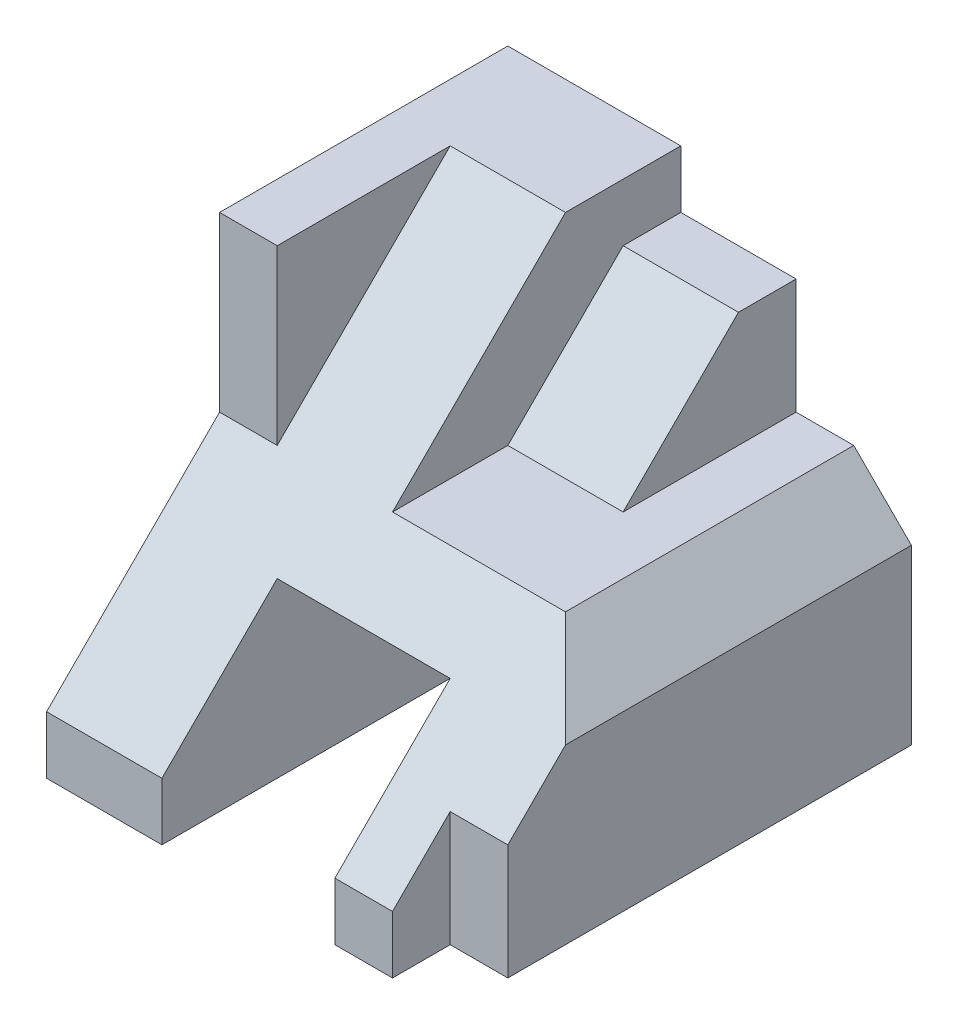
ISO-10303-21;
HEADER;
FILE_DESCRIPTION(('STEP AP214'),'2;1');
FILE_NAME('part.step','',(''),(''),'','','');
FILE_SCHEMA(('AUTOMOTIVE_DESIGN { 1 0 10303 214 1 1 1 1 }'));
ENDSEC;
DATA;
#1=APPLICATION_CONTEXT('core data for automotive mechanical design processes');
#2=APPLICATION_PROTOCOL_DEFINITION('international standard','automotive_design',2000,#1);
#3=PRODUCT_CONTEXT('',#1,'mechanical');
#4=PRODUCT('Part','Part','',(#3));
#5=PRODUCT_RELATED_PRODUCT_CATEGORY('part','',(#4));
#6=PRODUCT_DEFINITION_FORMATION('','',#4);
#7=PRODUCT_DEFINITION_CONTEXT('part definition',#1,'design');
#8=PRODUCT_DEFINITION('design','',#6,#7);
#9=PRODUCT_DEFINITION_SHAPE('','',#8);
#10=(LENGTH_UNIT() NAMED_UNIT(*) SI_UNIT(.MILLI.,.METRE.));
#11=(NAMED_UNIT(*) PLANE_ANGLE_UNIT() SI_UNIT($,.RADIAN.));
#12=(NAMED_UNIT(*) SI_UNIT($,.STERADIAN.) SOLID_ANGLE_UNIT());
#13=UNCERTAINTY_MEASURE_WITH_UNIT(LENGTH_MEASURE(1.E-05),#10,'distance_accuracy_value','');
#14=(GEOMETRIC_REPRESENTATION_CONTEXT(3) GLOBAL_UNCERTAINTY_ASSIGNED_CONTEXT((#13)) GLOBAL_UNIT_ASSIGNED_CONTEXT((#10,
#11,#12)) REPRESENTATION_CONTEXT('',''));
#15=CARTESIAN_POINT('',(0.,0.,0.));
#16=DIRECTION('',(0.,0.,1.));
#17=DIRECTION('',(1.,0.,0.));
#18=AXIS2_PLACEMENT_3D('',#15,#16,#17);
#19=CARTESIAN_POINT('',(3.5,-3.5,8.));
#20=DIRECTION('',(-1.,0.,0.));
#21=DIRECTION('',(0.,0.,1.));
#22=AXIS2_PLACEMENT_3D('',#19,#20,#21);
#23=PLANE('',#22);
#24=DIRECTION('',(0.,1.,0.));
#25=VECTOR('',#24,1.);
#26=CARTESIAN_POINT('',(3.5,-3.5,0.));
#27=LINE('',#26,#25);
#28=CARTESIAN_POINT('',(3.5,-3.5,0.));
#29=VERTEX_POINT('',#28);
#30=CARTESIAN_POINT('',(3.5,-0.500000000000017,0.));
#31=VERTEX_POINT('',#30);
#32=EDGE_CURVE('E183',#29,#31,#27,.T.);
#33=ORIENTED_EDGE('',*,*,#32,.T.);
#34=DIRECTION('',(0.,0.,-1.));
#35=VECTOR('',#34,1.);
#36=CARTESIAN_POINT('',(3.5,-0.500000000000017,6.));
#37=LINE('',#36,#35);
#38=CARTESIAN_POINT('',(3.5,-0.500000000000017,6.));
#39=VERTEX_POINT('',#38);
#40=EDGE_CURVE('E170',#39,#31,#37,.T.);
#41=ORIENTED_EDGE('',*,*,#40,.F.);
#42=DIRECTION('',(0.,0.707106781186547,-0.707106781186548));
#43=VECTOR('',#42,1.);
#44=CARTESIAN_POINT('',(3.5,-2.5,8.));
#45=LINE('',#44,#43);
#46=CARTESIAN_POINT('',(3.5,-1.5,7.));
#47=VERTEX_POINT('',#46);
#48=EDGE_CURVE('E181',#47,#39,#45,.T.);
#49=ORIENTED_EDGE('',*,*,#48,.F.);
#50=DIRECTION('',(0.,1.,0.));
#51=VECTOR('',#50,1.);
#52=CARTESIAN_POINT('',(3.5,-3.5,7.));
#53=LINE('',#52,#51);
#54=CARTESIAN_POINT('',(3.5,-3.5,7.));
#55=VERTEX_POINT('',#54);
#56=EDGE_CURVE('E284',#55,#47,#53,.T.);
#57=ORIENTED_EDGE('',*,*,#56,.F.);
#58=DIRECTION('',(0.,0.,-1.));
#59=VECTOR('',#58,1.);
#60=CARTESIAN_POINT('',(3.5,-3.5,8.));
#61=LINE('',#60,#59);
#62=EDGE_CURVE('E256',#55,#29,#61,.T.);
#63=ORIENTED_EDGE('',*,*,#62,.T.);
#64=EDGE_LOOP('',(#33,#41,#49,#57,#63));
#65=FACE_BOUND('',#64,.T.);
#66=ADVANCED_FACE('F33',(#65),#23,.F.);
#67=CARTESIAN_POINT('',(3.5,3.5,8.));
#68=DIRECTION('',(0.,-1.,0.));
#69=DIRECTION('',(1.,0.,0.));
#70=AXIS2_PLACEMENT_3D('',#67,#68,#69);
#71=PLANE('',#70);
#72=DIRECTION('',(0.,0.,1.));
#73=VECTOR('',#72,1.);
#74=CARTESIAN_POINT('',(-0.5,3.5,0.));
#75=LINE('',#74,#73);
#76=CARTESIAN_POINT('',(-0.5,3.5,0.));
#77=VERTEX_POINT('',#76);
#78=CARTESIAN_POINT('',(-0.5,3.5,2.));
#79=VERTEX_POINT('',#78);
#80=EDGE_CURVE('E358',#77,#79,#75,.T.);
#81=ORIENTED_EDGE('',*,*,#80,.F.);
#82=DIRECTION('',(-1.,0.,0.));
#83=VECTOR('',#82,1.);
#84=CARTESIAN_POINT('',(3.5,3.5,0.));
#85=LINE('',#84,#83);
#86=CARTESIAN_POINT('',(-3.5,3.5,0.));
#87=VERTEX_POINT('',#86);
#88=EDGE_CURVE('E241',#77,#87,#85,.T.);
#89=ORIENTED_EDGE('',*,*,#88,.T.);
#90=DIRECTION('',(0.,0.,-1.));
#91=VECTOR('',#90,1.);
#92=CARTESIAN_POINT('',(-3.5,3.5,8.));
#93=LINE('',#92,#91);
#94=CARTESIAN_POINT('',(-3.5,3.5,5.));
#95=VERTEX_POINT('',#94);
#96=EDGE_CURVE('E245',#95,#87,#93,.T.);
#97=ORIENTED_EDGE('',*,*,#96,.F.);
#98=DIRECTION('',(1.,0.,0.));
#99=VECTOR('',#98,1.);
#100=CARTESIAN_POINT('',(-8.5,3.5,5.));
#101=LINE('',#100,#99);
#102=CARTESIAN_POINT('',(-2.5,3.5,5.));
#103=VERTEX_POINT('',#102);
#104=EDGE_CURVE('E305',#95,#103,#101,.T.);
#105=ORIENTED_EDGE('',*,*,#104,.T.);
#106=DIRECTION('',(0.,0.,1.));
#107=VECTOR('',#106,1.);
#108=CARTESIAN_POINT('',(-2.5,3.5,2.));
#109=LINE('',#108,#107);
#110=CARTESIAN_POINT('',(-2.5,3.5,2.));
#111=VERTEX_POINT('',#110);
#112=EDGE_CURVE('E193',#111,#103,#109,.T.);
#113=ORIENTED_EDGE('',*,*,#112,.F.);
#114=DIRECTION('',(1.,0.,0.));
#115=VECTOR('',#114,1.);
#116=CARTESIAN_POINT('',(-2.5,3.5,2.));
#117=LINE('',#116,#115);
#118=EDGE_CURVE('E200',#111,#79,#117,.T.);
#119=ORIENTED_EDGE('',*,*,#118,.T.);
#120=EDGE_LOOP('',(#81,#89,#97,#105,#113,#119));
#121=FACE_BOUND('',#120,.T.);
#122=ADVANCED_FACE('F373',(#121),#71,.F.);
#123=CARTESIAN_POINT('',(0.,0.,8.));
#124=DIRECTION('',(0.,0.,1.));
#125=DIRECTION('',(1.,0.,0.));
#126=AXIS2_PLACEMENT_3D('',#123,#124,#125);
#127=PLANE('',#126);
#128=DIRECTION('',(1.,0.,0.));
#129=VECTOR('',#128,1.);
#130=CARTESIAN_POINT('',(3.5,-3.5,8.));
#131=LINE('',#130,#129);
#132=CARTESIAN_POINT('',(1.5,-3.5,8.));
#133=VERTEX_POINT('',#132);
#134=CARTESIAN_POINT('',(2.5,-3.5,8.));
#135=VERTEX_POINT('',#134);
#136=EDGE_CURVE('E240',#133,#135,#131,.T.);
#137=ORIENTED_EDGE('',*,*,#136,.T.);
#138=DIRECTION('',(0.,-1.,0.));
#139=VECTOR('',#138,1.);
#140=CARTESIAN_POINT('',(2.5,-1.5,8.));
#141=LINE('',#140,#139);
#142=CARTESIAN_POINT('',(2.5,-2.5,8.));
#143=VERTEX_POINT('',#142);
#144=EDGE_CURVE('E291',#143,#135,#141,.T.);
#145=ORIENTED_EDGE('',*,*,#144,.F.);
#146=DIRECTION('',(1.,0.,0.));
#147=VECTOR('',#146,1.);
#148=CARTESIAN_POINT('',(-2.5,-2.5,8.));
#149=LINE('',#148,#147);
#150=CARTESIAN_POINT('',(1.5,-2.5,8.));
#151=VERTEX_POINT('',#150);
#152=EDGE_CURVE('E206',#151,#143,#149,.T.);
#153=ORIENTED_EDGE('',*,*,#152,.F.);
#154=DIRECTION('',(0.,1.,0.));
#155=VECTOR('',#154,1.);
#156=CARTESIAN_POINT('',(1.5,-0.5,8.));
#157=LINE('',#156,#155);
#158=EDGE_CURVE('E212',#133,#151,#157,.T.);
#159=ORIENTED_EDGE('',*,*,#158,.F.);
#160=EDGE_LOOP('',(#137,#145,#153,#159));
#161=FACE_BOUND('',#160,.T.);
#162=ADVANCED_FACE('F332',(#161),#127,.T.);
#163=CARTESIAN_POINT('',(3.5,-3.5,8.));
#164=DIRECTION('',(0.,1.,0.));
#165=DIRECTION('',(-1.,0.,0.));
#166=AXIS2_PLACEMENT_3D('',#163,#164,#165);
#167=PLANE('',#166);
#168=DIRECTION('',(1.,0.,0.));
#169=VECTOR('',#168,1.);
#170=CARTESIAN_POINT('',(3.5,-3.5,0.));
#171=LINE('',#170,#169);
#172=CARTESIAN_POINT('',(-3.5,-3.5,0.));
#173=VERTEX_POINT('',#172);
#174=CARTESIAN_POINT('',(-1.5,-3.5,0.));
#175=VERTEX_POINT('',#174);
#176=EDGE_CURVE('E249',#173,#175,#171,.T.);
#177=ORIENTED_EDGE('',*,*,#176,.T.);
#178=DIRECTION('',(0.,0.,1.));
#179=VECTOR('',#178,1.);
#180=CARTESIAN_POINT('',(-1.5,-3.5,0.));
#181=LINE('',#180,#179);
#182=CARTESIAN_POINT('',(-1.5,-3.5,8.));
#183=VERTEX_POINT('',#182);
#184=EDGE_CURVE('E227',#175,#183,#181,.T.);
#185=ORIENTED_EDGE('',*,*,#184,.T.);
#186=CARTESIAN_POINT('',(-3.5,-3.5,8.));
#187=VERTEX_POINT('',#186);
#188=EDGE_CURVE('E242',#187,#183,#131,.T.);
#189=ORIENTED_EDGE('',*,*,#188,.F.);
#190=DIRECTION('',(0.,0.,-1.));
#191=VECTOR('',#190,1.);
#192=CARTESIAN_POINT('',(-3.5,-3.5,8.));
#193=LINE('',#192,#191);
#194=EDGE_CURVE('E258',#187,#173,#193,.T.);
#195=ORIENTED_EDGE('',*,*,#194,.T.);
#196=EDGE_LOOP('',(#177,#185,#189,#195));
#197=FACE_BOUND('',#196,.T.);
#198=ADVANCED_FACE('F376',(#197),#167,.F.);
#199=CARTESIAN_POINT('',(-3.5,-3.5,8.));
#200=DIRECTION('',(1.,0.,0.));
#201=DIRECTION('',(0.,0.,-1.));
#202=AXIS2_PLACEMENT_3D('',#199,#200,#201);
#203=PLANE('',#202);
#204=DIRECTION('',(0.,0.707106781186548,-0.707106781186547));
#205=VECTOR('',#204,1.);
#206=CARTESIAN_POINT('',(-3.5,-3.,8.5));
#207=LINE('',#206,#205);
#208=CARTESIAN_POINT('',(-3.5,-2.5,8.));
#209=VERTEX_POINT('',#208);
#210=CARTESIAN_POINT('',(-3.5,0.500000000000002,5.));
#211=VERTEX_POINT('',#210);
#212=EDGE_CURVE('E196',#209,#211,#207,.T.);
#213=ORIENTED_EDGE('',*,*,#212,.T.);
#214=DIRECTION('',(0.,1.,0.));
#215=VECTOR('',#214,1.);
#216=CARTESIAN_POINT('',(-3.5,-3.5,5.));
#217=LINE('',#216,#215);
#218=EDGE_CURVE('E191',#211,#95,#217,.T.);
#219=ORIENTED_EDGE('',*,*,#218,.T.);
#220=ORIENTED_EDGE('',*,*,#96,.T.);
#221=DIRECTION('',(0.,-1.,0.));
#222=VECTOR('',#221,1.);
#223=CARTESIAN_POINT('',(-3.5,-3.5,0.));
#224=LINE('',#223,#222);
#225=EDGE_CURVE('E230',#87,#173,#224,.T.);
#226=ORIENTED_EDGE('',*,*,#225,.T.);
#227=ORIENTED_EDGE('',*,*,#194,.F.);
#228=DIRECTION('',(0.,-1.,0.));
#229=VECTOR('',#228,1.);
#230=CARTESIAN_POINT('',(-3.5,-3.5,8.));
#231=LINE('',#230,#229);
#232=EDGE_CURVE('E238',#209,#187,#231,.T.);
#233=ORIENTED_EDGE('',*,*,#232,.F.);
#234=EDGE_LOOP('',(#213,#219,#220,#226,#227,#233));
#235=FACE_BOUND('',#234,.T.);
#236=ADVANCED_FACE('F35',(#235),#203,.F.);
#237=ORIENTED_EDGE('',*,*,#62,.F.);
#238=DIRECTION('',(1.,0.,0.));
#239=VECTOR('',#238,1.);
#240=CARTESIAN_POINT('',(2.5,-3.5,7.));
#241=LINE('',#240,#239);
#242=CARTESIAN_POINT('',(2.5,-3.5,7.));
#243=VERTEX_POINT('',#242);
#244=EDGE_CURVE('E298',#243,#55,#241,.T.);
#245=ORIENTED_EDGE('',*,*,#244,.F.);
#246=DIRECTION('',(0.,0.,-1.));
#247=VECTOR('',#246,1.);
#248=CARTESIAN_POINT('',(2.5,-3.5,8.));
#249=LINE('',#248,#247);
#250=EDGE_CURVE('E293',#135,#243,#249,.T.);
#251=ORIENTED_EDGE('',*,*,#250,.F.);
#252=ORIENTED_EDGE('',*,*,#136,.F.);
#253=DIRECTION('',(0.,0.,1.));
#254=VECTOR('',#253,1.);
#255=CARTESIAN_POINT('',(1.5,-3.5,0.));
#256=LINE('',#255,#254);
#257=CARTESIAN_POINT('',(1.5,-3.5,0.));
#258=VERTEX_POINT('',#257);
#259=EDGE_CURVE('E223',#258,#133,#256,.T.);
#260=ORIENTED_EDGE('',*,*,#259,.F.);
#261=EDGE_CURVE('E248',#258,#29,#171,.T.);
#262=ORIENTED_EDGE('',*,*,#261,.T.);
#263=EDGE_LOOP('',(#237,#245,#251,#252,#260,#262));
#264=FACE_BOUND('',#263,.T.);
#265=ADVANCED_FACE('F342',(#264),#167,.F.);
#266=CARTESIAN_POINT('',(-1.5,-2.5,8.));
#267=VERTEX_POINT('',#266);
#268=EDGE_CURVE('E204',#209,#267,#149,.T.);
#269=ORIENTED_EDGE('',*,*,#268,.F.);
#270=ORIENTED_EDGE('',*,*,#232,.T.);
#271=ORIENTED_EDGE('',*,*,#188,.T.);
#272=DIRECTION('',(0.,-1.,0.));
#273=VECTOR('',#272,1.);
#274=CARTESIAN_POINT('',(-1.5,-3.5,8.));
#275=LINE('',#274,#273);
#276=EDGE_CURVE('E217',#267,#183,#275,.T.);
#277=ORIENTED_EDGE('',*,*,#276,.F.);
#278=EDGE_LOOP('',(#269,#270,#271,#277));
#279=FACE_BOUND('',#278,.T.);
#280=ADVANCED_FACE('F379',(#279),#127,.T.);
#281=CARTESIAN_POINT('',(0.,0.,0.));
#282=DIRECTION('',(0.,0.,1.));
#283=DIRECTION('',(1.,0.,0.));
#284=AXIS2_PLACEMENT_3D('',#281,#282,#283);
#285=PLANE('',#284);
#286=DIRECTION('',(-1.,0.,0.));
#287=VECTOR('',#286,1.);
#288=CARTESIAN_POINT('',(3.5,0.500000000000001,0.));
#289=LINE('',#288,#287);
#290=CARTESIAN_POINT('',(2.5,0.500000000000001,0.));
#291=VERTEX_POINT('',#290);
#292=CARTESIAN_POINT('',(1.5,0.500000000000001,0.));
#293=VERTEX_POINT('',#292);
#294=EDGE_CURVE('E348',#291,#293,#289,.T.);
#295=ORIENTED_EDGE('',*,*,#294,.F.);
#296=DIRECTION('',(-0.707106781186541,0.707106781186554,0.));
#297=VECTOR('',#296,1.);
#298=CARTESIAN_POINT('',(2.5,0.500000000000001,0.));
#299=LINE('',#298,#297);
#300=EDGE_CURVE('E48',#31,#291,#299,.T.);
#301=ORIENTED_EDGE('',*,*,#300,.F.);
#302=ORIENTED_EDGE('',*,*,#32,.F.);
#303=ORIENTED_EDGE('',*,*,#261,.F.);
#304=DIRECTION('',(0.,1.,0.));
#305=VECTOR('',#304,1.);
#306=CARTESIAN_POINT('',(1.5,-0.5,0.));
#307=LINE('',#306,#305);
#308=CARTESIAN_POINT('',(1.5,-0.5,0.));
#309=VERTEX_POINT('',#308);
#310=EDGE_CURVE('E213',#258,#309,#307,.T.);
#311=ORIENTED_EDGE('',*,*,#310,.T.);
#312=DIRECTION('',(-1.,0.,0.));
#313=VECTOR('',#312,1.);
#314=CARTESIAN_POINT('',(-1.5,-0.5,0.));
#315=LINE('',#314,#313);
#316=CARTESIAN_POINT('',(-1.5,-0.5,0.));
#317=VERTEX_POINT('',#316);
#318=EDGE_CURVE('E216',#309,#317,#315,.T.);
#319=ORIENTED_EDGE('',*,*,#318,.T.);
#320=DIRECTION('',(0.,-1.,0.));
#321=VECTOR('',#320,1.);
#322=CARTESIAN_POINT('',(-1.5,-3.5,0.));
#323=LINE('',#322,#321);
#324=EDGE_CURVE('E220',#317,#175,#323,.T.);
#325=ORIENTED_EDGE('',*,*,#324,.T.);
#326=ORIENTED_EDGE('',*,*,#176,.F.);
#327=ORIENTED_EDGE('',*,*,#225,.F.);
#328=ORIENTED_EDGE('',*,*,#88,.F.);
#329=DIRECTION('',(0.,1.,0.));
#330=VECTOR('',#329,1.);
#331=CARTESIAN_POINT('',(-0.5,2.5,0.));
#332=LINE('',#331,#330);
#333=CARTESIAN_POINT('',(-0.5,2.5,0.));
#334=VERTEX_POINT('',#333);
#335=EDGE_CURVE('E356',#334,#77,#332,.T.);
#336=ORIENTED_EDGE('',*,*,#335,.F.);
#337=DIRECTION('',(1.,0.,0.));
#338=VECTOR('',#337,1.);
#339=CARTESIAN_POINT('',(-0.5,2.5,0.));
#340=LINE('',#339,#338);
#341=CARTESIAN_POINT('',(1.5,2.5,0.));
#342=VERTEX_POINT('',#341);
#343=EDGE_CURVE('E282',#334,#342,#340,.T.);
#344=ORIENTED_EDGE('',*,*,#343,.T.);
#345=DIRECTION('',(0.,1.,0.));
#346=VECTOR('',#345,1.);
#347=CARTESIAN_POINT('',(1.5,0.500000000000001,0.));
#348=LINE('',#347,#346);
#349=EDGE_CURVE('E353',#293,#342,#348,.T.);
#350=ORIENTED_EDGE('',*,*,#349,.F.);
#351=EDGE_LOOP('',(#295,#301,#302,#303,#311,#319,#325,#326,#327,#328,#336,#344,#350));
#352=FACE_BOUND('',#351,.T.);
#353=ADVANCED_FACE('F346',(#352),#285,.F.);
#354=CARTESIAN_POINT('',(-1.5,-3.5,0.));
#355=DIRECTION('',(-1.,0.,0.));
#356=DIRECTION('',(0.,0.,1.));
#357=AXIS2_PLACEMENT_3D('',#354,#355,#356);
#358=PLANE('',#357);
#359=DIRECTION('',(0.,0.,1.));
#360=VECTOR('',#359,1.);
#361=CARTESIAN_POINT('',(-1.5,-0.5,0.));
#362=LINE('',#361,#360);
#363=CARTESIAN_POINT('',(-1.5,-0.5,6.));
#364=VERTEX_POINT('',#363);
#365=EDGE_CURVE('E231',#317,#364,#362,.T.);
#366=ORIENTED_EDGE('',*,*,#365,.T.);
#367=DIRECTION('',(0.,-0.707106781186547,0.707106781186548));
#368=VECTOR('',#367,1.);
#369=CARTESIAN_POINT('',(-1.5,1.,4.5));
#370=LINE('',#369,#368);
#371=EDGE_CURVE('E209',#364,#267,#370,.T.);
#372=ORIENTED_EDGE('',*,*,#371,.T.);
#373=ORIENTED_EDGE('',*,*,#276,.T.);
#374=ORIENTED_EDGE('',*,*,#184,.F.);
#375=ORIENTED_EDGE('',*,*,#324,.F.);
#376=EDGE_LOOP('',(#366,#372,#373,#374,#375));
#377=FACE_BOUND('',#376,.T.);
#378=ADVANCED_FACE('F381',(#377),#358,.F.);
#379=CARTESIAN_POINT('',(-1.5,-0.5,0.));
#380=DIRECTION('',(0.,1.,0.));
#381=DIRECTION('',(0.,0.,1.));
#382=AXIS2_PLACEMENT_3D('',#379,#380,#381);
#383=PLANE('',#382);
#384=DIRECTION('',(0.,0.,1.));
#385=VECTOR('',#384,1.);
#386=CARTESIAN_POINT('',(1.5,-0.5,0.));
#387=LINE('',#386,#385);
#388=CARTESIAN_POINT('',(1.5,-0.5,6.));
#389=VERTEX_POINT('',#388);
#390=EDGE_CURVE('E234',#309,#389,#387,.T.);
#391=ORIENTED_EDGE('',*,*,#390,.T.);
#392=DIRECTION('',(-1.,0.,0.));
#393=VECTOR('',#392,1.);
#394=CARTESIAN_POINT('',(-1.5,-0.5,6.));
#395=LINE('',#394,#393);
#396=EDGE_CURVE('E203',#389,#364,#395,.T.);
#397=ORIENTED_EDGE('',*,*,#396,.T.);
#398=ORIENTED_EDGE('',*,*,#365,.F.);
#399=ORIENTED_EDGE('',*,*,#318,.F.);
#400=EDGE_LOOP('',(#391,#397,#398,#399));
#401=FACE_BOUND('',#400,.T.);
#402=ADVANCED_FACE('F384',(#401),#383,.F.);
#403=CARTESIAN_POINT('',(1.5,-0.5,0.));
#404=DIRECTION('',(1.,0.,0.));
#405=DIRECTION('',(0.,0.,-1.));
#406=AXIS2_PLACEMENT_3D('',#403,#404,#405);
#407=PLANE('',#406);
#408=ORIENTED_EDGE('',*,*,#158,.T.);
#409=DIRECTION('',(0.,0.707106781186547,-0.707106781186548));
#410=VECTOR('',#409,1.);
#411=CARTESIAN_POINT('',(1.5,2.5,3.));
#412=LINE('',#411,#410);
#413=EDGE_CURVE('E261',#151,#389,#412,.T.);
#414=ORIENTED_EDGE('',*,*,#413,.T.);
#415=ORIENTED_EDGE('',*,*,#390,.F.);
#416=ORIENTED_EDGE('',*,*,#310,.F.);
#417=ORIENTED_EDGE('',*,*,#259,.T.);
#418=EDGE_LOOP('',(#408,#414,#415,#416,#417));
#419=FACE_BOUND('',#418,.T.);
#420=ADVANCED_FACE('F335',(#419),#407,.F.);
#421=CARTESIAN_POINT('',(-2.5,-2.5,8.));
#422=DIRECTION('',(0.,-0.707106781186548,-0.707106781186547));
#423=DIRECTION('',(0.,0.707106781186547,-0.707106781186548));
#424=AXIS2_PLACEMENT_3D('',#421,#422,#423);
#425=PLANE('',#424);
#426=ORIENTED_EDGE('',*,*,#48,.T.);
#427=DIRECTION('',(-0.577350269189619,0.577350269189629,-0.577350269189629));
#428=VECTOR('',#427,1.);
#429=CARTESIAN_POINT('',(2.83333333333336,0.166666666666634,5.33333333333337));
#430=LINE('',#429,#428);
#431=CARTESIAN_POINT('',(2.5,0.500000000000001,5.));
#432=VERTEX_POINT('',#431);
#433=EDGE_CURVE('E167',#39,#432,#430,.T.);
#434=ORIENTED_EDGE('',*,*,#433,.T.);
#435=DIRECTION('',(1.,0.,0.));
#436=VECTOR('',#435,1.);
#437=CARTESIAN_POINT('',(-0.5,0.500000000000002,5.));
#438=LINE('',#437,#436);
#439=CARTESIAN_POINT('',(-0.5,0.500000000000002,5.));
#440=VERTEX_POINT('',#439);
#441=EDGE_CURVE('E286',#440,#432,#438,.T.);
#442=ORIENTED_EDGE('',*,*,#441,.F.);
#443=DIRECTION('',(0.,-0.707106781186547,0.707106781186548));
#444=VECTOR('',#443,1.);
#445=CARTESIAN_POINT('',(-0.5,3.5,2.));
#446=LINE('',#445,#444);
#447=EDGE_CURVE('E360',#79,#440,#446,.T.);
#448=ORIENTED_EDGE('',*,*,#447,.F.);
#449=ORIENTED_EDGE('',*,*,#118,.F.);
#450=DIRECTION('',(0.,0.707106781186547,-0.707106781186548));
#451=VECTOR('',#450,1.);
#452=CARTESIAN_POINT('',(-2.5,-2.5,8.));
#453=LINE('',#452,#451);
#454=CARTESIAN_POINT('',(-2.5,0.500000000000002,5.));
#455=VERTEX_POINT('',#454);
#456=EDGE_CURVE('E190',#455,#111,#453,.T.);
#457=ORIENTED_EDGE('',*,*,#456,.F.);
#458=DIRECTION('',(1.,0.,0.));
#459=VECTOR('',#458,1.);
#460=CARTESIAN_POINT('',(-8.5,0.500000000000002,5.));
#461=LINE('',#460,#459);
#462=EDGE_CURVE('E304',#211,#455,#461,.T.);
#463=ORIENTED_EDGE('',*,*,#462,.F.);
#464=ORIENTED_EDGE('',*,*,#212,.F.);
#465=ORIENTED_EDGE('',*,*,#268,.T.);
#466=ORIENTED_EDGE('',*,*,#371,.F.);
#467=ORIENTED_EDGE('',*,*,#396,.F.);
#468=ORIENTED_EDGE('',*,*,#413,.F.);
#469=ORIENTED_EDGE('',*,*,#152,.T.);
#470=DIRECTION('',(0.,-0.707106781186547,0.707106781186548));
#471=VECTOR('',#470,1.);
#472=CARTESIAN_POINT('',(2.5,-2.5,8.));
#473=LINE('',#472,#471);
#474=CARTESIAN_POINT('',(2.5,-1.5,7.));
#475=VERTEX_POINT('',#474);
#476=EDGE_CURVE('E264',#475,#143,#473,.T.);
#477=ORIENTED_EDGE('',*,*,#476,.F.);
#478=DIRECTION('',(1.,0.,0.));
#479=VECTOR('',#478,1.);
#480=CARTESIAN_POINT('',(2.5,-1.5,7.));
#481=LINE('',#480,#479);
#482=EDGE_CURVE('E189',#475,#47,#481,.T.);
#483=ORIENTED_EDGE('',*,*,#482,.T.);
#484=EDGE_LOOP('',(#426,#434,#442,#448,#449,#457,#463,#464,#465,#466,#467,#468,#469,#477,#483));
#485=FACE_BOUND('',#484,.T.);
#486=ADVANCED_FACE('F186',(#485),#425,.F.);
#487=CARTESIAN_POINT('',(-2.5,0.,0.));
#488=DIRECTION('',(-1.,0.,0.));
#489=DIRECTION('',(0.,0.,1.));
#490=AXIS2_PLACEMENT_3D('',#487,#488,#489);
#491=PLANE('',#490);
#492=ORIENTED_EDGE('',*,*,#112,.T.);
#493=DIRECTION('',(0.,1.,0.));
#494=VECTOR('',#493,1.);
#495=CARTESIAN_POINT('',(-2.5,3.5,5.));
#496=LINE('',#495,#494);
#497=EDGE_CURVE('E301',#455,#103,#496,.T.);
#498=ORIENTED_EDGE('',*,*,#497,.F.);
#499=ORIENTED_EDGE('',*,*,#456,.T.);
#500=EDGE_LOOP('',(#492,#498,#499));
#501=FACE_BOUND('',#500,.T.);
#502=ADVANCED_FACE('F323',(#501),#491,.F.);
#503=CARTESIAN_POINT('',(-8.5,3.5,5.));
#504=DIRECTION('',(0.,0.,-1.));
#505=DIRECTION('',(0.,1.,0.));
#506=AXIS2_PLACEMENT_3D('',#503,#504,#505);
#507=PLANE('',#506);
#508=ORIENTED_EDGE('',*,*,#462,.T.);
#509=ORIENTED_EDGE('',*,*,#497,.T.);
#510=ORIENTED_EDGE('',*,*,#104,.F.);
#511=ORIENTED_EDGE('',*,*,#218,.F.);
#512=EDGE_LOOP('',(#508,#509,#510,#511));
#513=FACE_BOUND('',#512,.T.);
#514=ADVANCED_FACE('F320',(#513),#507,.F.);
#515=CARTESIAN_POINT('',(2.5,0.,0.));
#516=DIRECTION('',(1.,0.,0.));
#517=DIRECTION('',(0.,0.,-1.));
#518=AXIS2_PLACEMENT_3D('',#515,#516,#517);
#519=PLANE('',#518);
#520=ORIENTED_EDGE('',*,*,#476,.T.);
#521=ORIENTED_EDGE('',*,*,#144,.T.);
#522=ORIENTED_EDGE('',*,*,#250,.T.);
#523=DIRECTION('',(0.,1.,0.));
#524=VECTOR('',#523,1.);
#525=CARTESIAN_POINT('',(2.5,-3.5,7.));
#526=LINE('',#525,#524);
#527=EDGE_CURVE('E296',#243,#475,#526,.T.);
#528=ORIENTED_EDGE('',*,*,#527,.T.);
#529=EDGE_LOOP('',(#520,#521,#522,#528));
#530=FACE_BOUND('',#529,.T.);
#531=ADVANCED_FACE('F464',(#530),#519,.T.);
#532=CARTESIAN_POINT('',(2.5,-3.5,7.));
#533=DIRECTION('',(0.,0.,-1.));
#534=DIRECTION('',(-1.,0.,0.));
#535=AXIS2_PLACEMENT_3D('',#532,#533,#534);
#536=PLANE('',#535);
#537=ORIENTED_EDGE('',*,*,#56,.T.);
#538=ORIENTED_EDGE('',*,*,#482,.F.);
#539=ORIENTED_EDGE('',*,*,#527,.F.);
#540=ORIENTED_EDGE('',*,*,#244,.T.);
#541=EDGE_LOOP('',(#537,#538,#539,#540));
#542=FACE_BOUND('',#541,.T.);
#543=ADVANCED_FACE('F481',(#542),#536,.F.);
#544=CARTESIAN_POINT('',(-0.5,2.5,1.));
#545=DIRECTION('',(0.,-1.,0.));
#546=DIRECTION('',(0.,0.,-1.));
#547=AXIS2_PLACEMENT_3D('',#544,#545,#546);
#548=PLANE('',#547);
#549=DIRECTION('',(1.,0.,0.));
#550=VECTOR('',#549,1.);
#551=CARTESIAN_POINT('',(-0.5,2.5,1.));
#552=LINE('',#551,#550);
#553=CARTESIAN_POINT('',(-0.5,2.5,1.));
#554=VERTEX_POINT('',#553);
#555=CARTESIAN_POINT('',(1.5,2.5,1.));
#556=VERTEX_POINT('',#555);
#557=EDGE_CURVE('E271',#554,#556,#552,.T.);
#558=ORIENTED_EDGE('',*,*,#557,.T.);
#559=DIRECTION('',(0.,0.,1.));
#560=VECTOR('',#559,1.);
#561=CARTESIAN_POINT('',(1.5,2.5,0.));
#562=LINE('',#561,#560);
#563=EDGE_CURVE('E175',#342,#556,#562,.T.);
#564=ORIENTED_EDGE('',*,*,#563,.F.);
#565=ORIENTED_EDGE('',*,*,#343,.F.);
#566=DIRECTION('',(0.,0.,-1.));
#567=VECTOR('',#566,1.);
#568=CARTESIAN_POINT('',(-0.5,2.5,1.));
#569=LINE('',#568,#567);
#570=EDGE_CURVE('E281',#554,#334,#569,.T.);
#571=ORIENTED_EDGE('',*,*,#570,.F.);
#572=EDGE_LOOP('',(#558,#564,#565,#571));
#573=FACE_BOUND('',#572,.T.);
#574=ADVANCED_FACE('F278',(#573),#548,.F.);
#575=CARTESIAN_POINT('',(-0.5,0.500000000000002,3.));
#576=DIRECTION('',(0.,-0.707106781186547,-0.707106781186547));
#577=DIRECTION('',(0.,0.707106781186548,-0.707106781186548));
#578=AXIS2_PLACEMENT_3D('',#575,#576,#577);
#579=PLANE('',#578);
#580=DIRECTION('',(1.,0.,0.));
#581=VECTOR('',#580,1.);
#582=CARTESIAN_POINT('',(-0.5,0.500000000000002,3.));
#583=LINE('',#582,#581);
#584=CARTESIAN_POINT('',(-0.5,0.500000000000002,3.));
#585=VERTEX_POINT('',#584);
#586=CARTESIAN_POINT('',(1.5,0.500000000000002,3.));
#587=VERTEX_POINT('',#586);
#588=EDGE_CURVE('E273',#585,#587,#583,.T.);
#589=ORIENTED_EDGE('',*,*,#588,.T.);
#590=DIRECTION('',(0.,0.707106781186548,-0.707106781186548));
#591=VECTOR('',#590,1.);
#592=CARTESIAN_POINT('',(1.5,0.500000000000002,3.));
#593=LINE('',#592,#591);
#594=EDGE_CURVE('E41',#587,#556,#593,.T.);
#595=ORIENTED_EDGE('',*,*,#594,.T.);
#596=ORIENTED_EDGE('',*,*,#557,.F.);
#597=DIRECTION('',(0.,0.707106781186548,-0.707106781186548));
#598=VECTOR('',#597,1.);
#599=CARTESIAN_POINT('',(-0.5,0.500000000000002,3.));
#600=LINE('',#599,#598);
#601=EDGE_CURVE('E366',#585,#554,#600,.T.);
#602=ORIENTED_EDGE('',*,*,#601,.F.);
#603=EDGE_LOOP('',(#589,#595,#596,#602));
#604=FACE_BOUND('',#603,.T.);
#605=ADVANCED_FACE('F269',(#604),#579,.F.);
#606=CARTESIAN_POINT('',(-0.5,0.500000000000002,5.));
#607=DIRECTION('',(0.,-1.,0.));
#608=DIRECTION('',(0.,0.,-1.));
#609=AXIS2_PLACEMENT_3D('',#606,#607,#608);
#610=PLANE('',#609);
#611=ORIENTED_EDGE('',*,*,#441,.T.);
#612=DIRECTION('',(0.,0.,-1.));
#613=VECTOR('',#612,1.);
#614=CARTESIAN_POINT('',(2.5,0.500000000000002,5.));
#615=LINE('',#614,#613);
#616=EDGE_CURVE('E11',#432,#291,#615,.T.);
#617=ORIENTED_EDGE('',*,*,#616,.T.);
#618=ORIENTED_EDGE('',*,*,#294,.T.);
#619=DIRECTION('',(0.,0.,1.));
#620=VECTOR('',#619,1.);
#621=CARTESIAN_POINT('',(1.5,0.500000000000001,0.));
#622=LINE('',#621,#620);
#623=EDGE_CURVE('E55',#293,#587,#622,.T.);
#624=ORIENTED_EDGE('',*,*,#623,.T.);
#625=ORIENTED_EDGE('',*,*,#588,.F.);
#626=DIRECTION('',(0.,0.,-1.));
#627=VECTOR('',#626,1.);
#628=CARTESIAN_POINT('',(-0.5,0.500000000000002,5.));
#629=LINE('',#628,#627);
#630=EDGE_CURVE('E363',#440,#585,#629,.T.);
#631=ORIENTED_EDGE('',*,*,#630,.F.);
#632=EDGE_LOOP('',(#611,#617,#618,#624,#625,#631));
#633=FACE_BOUND('',#632,.T.);
#634=ADVANCED_FACE('F509',(#633),#610,.F.);
#635=CARTESIAN_POINT('',(-0.5,0.,0.));
#636=DIRECTION('',(1.,0.,0.));
#637=DIRECTION('',(0.,0.,-1.));
#638=AXIS2_PLACEMENT_3D('',#635,#636,#637);
#639=PLANE('',#638);
#640=ORIENTED_EDGE('',*,*,#335,.T.);
#641=ORIENTED_EDGE('',*,*,#80,.T.);
#642=ORIENTED_EDGE('',*,*,#447,.T.);
#643=ORIENTED_EDGE('',*,*,#630,.T.);
#644=ORIENTED_EDGE('',*,*,#601,.T.);
#645=ORIENTED_EDGE('',*,*,#570,.T.);
#646=EDGE_LOOP('',(#640,#641,#642,#643,#644,#645));
#647=FACE_BOUND('',#646,.T.);
#648=ADVANCED_FACE('F369',(#647),#639,.T.);
#649=CARTESIAN_POINT('',(1.5,0.500000000000001,0.));
#650=DIRECTION('',(-1.,0.,0.));
#651=DIRECTION('',(0.,0.,1.));
#652=AXIS2_PLACEMENT_3D('',#649,#650,#651);
#653=PLANE('',#652);
#654=ORIENTED_EDGE('',*,*,#623,.F.);
#655=ORIENTED_EDGE('',*,*,#349,.T.);
#656=ORIENTED_EDGE('',*,*,#563,.T.);
#657=ORIENTED_EDGE('',*,*,#594,.F.);
#658=EDGE_LOOP('',(#654,#655,#656,#657));
#659=FACE_BOUND('',#658,.T.);
#660=ADVANCED_FACE('F508',(#659),#653,.F.);
#661=CARTESIAN_POINT('',(2.5,0.500000000000001,6.));
#662=DIRECTION('',(-0.707106781186554,-0.707106781186541,0.));
#663=DIRECTION('',(0.707106781186541,-0.707106781186554,0.));
#664=AXIS2_PLACEMENT_3D('',#661,#662,#663);
#665=PLANE('',#664);
#666=ORIENTED_EDGE('',*,*,#40,.T.);
#667=ORIENTED_EDGE('',*,*,#300,.T.);
#668=ORIENTED_EDGE('',*,*,#616,.F.);
#669=ORIENTED_EDGE('',*,*,#433,.F.);
#670=EDGE_LOOP('',(#666,#667,#668,#669));
#671=FACE_BOUND('',#670,.T.);
#672=ADVANCED_FACE('F169',(#671),#665,.F.);
#673=CLOSED_SHELL('',(#66,#122,#162,#198,#236,#265,#280,#353,#378,#402,#420,#486,#502,#514,#531,
#543,#574,#605,#634,#648,#660,#672));
#674=MANIFOLD_SOLID_BREP('B2',#673);
#675=ADVANCED_BREP_SHAPE_REPRESENTATION('',(#18,#674),#14);
#676=SHAPE_DEFINITION_REPRESENTATION(#9,#675);
ENDSEC;
END-ISO-10303-21;
